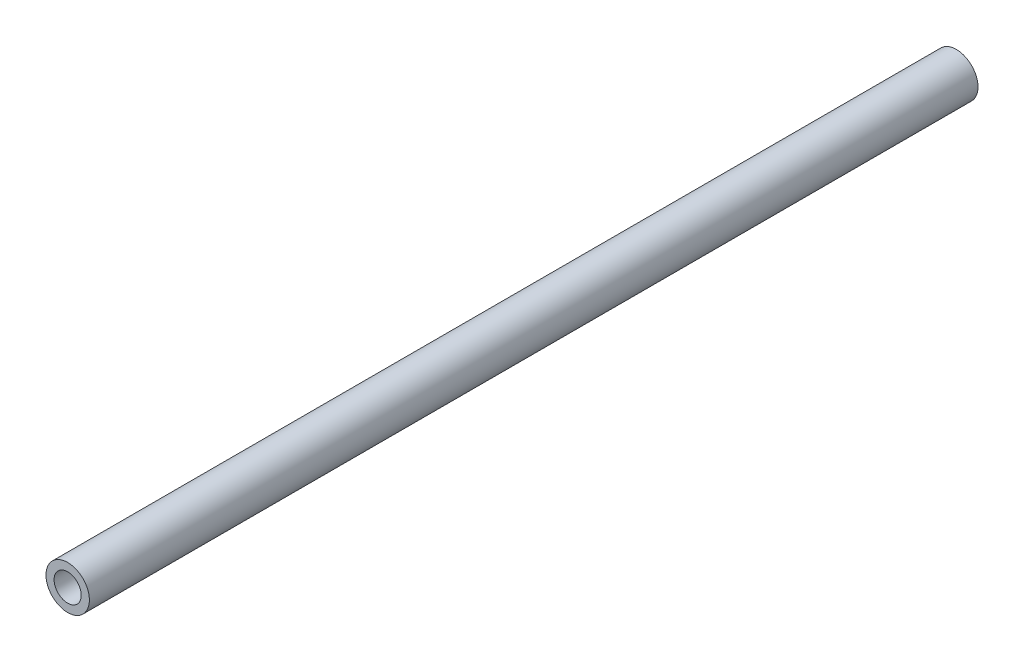
ISO-10303-21;
HEADER;
FILE_DESCRIPTION(('STEP AP214'),'2;1');
FILE_NAME('part.step','',(''),(''),'','','');
FILE_SCHEMA(('AUTOMOTIVE_DESIGN { 1 0 10303 214 1 1 1 1 }'));
ENDSEC;
DATA;
#1=APPLICATION_CONTEXT('core data for automotive mechanical design processes');
#2=APPLICATION_PROTOCOL_DEFINITION('international standard','automotive_design',2000,#1);
#3=PRODUCT_CONTEXT('',#1,'mechanical');
#4=PRODUCT('Part','Part','',(#3));
#5=PRODUCT_RELATED_PRODUCT_CATEGORY('part','',(#4));
#6=PRODUCT_DEFINITION_FORMATION('','',#4);
#7=PRODUCT_DEFINITION_CONTEXT('part definition',#1,'design');
#8=PRODUCT_DEFINITION('design','',#6,#7);
#9=PRODUCT_DEFINITION_SHAPE('','',#8);
#10=(LENGTH_UNIT() NAMED_UNIT(*) SI_UNIT(.MILLI.,.METRE.));
#11=(NAMED_UNIT(*) PLANE_ANGLE_UNIT() SI_UNIT($,.RADIAN.));
#12=(NAMED_UNIT(*) SI_UNIT($,.STERADIAN.) SOLID_ANGLE_UNIT());
#13=UNCERTAINTY_MEASURE_WITH_UNIT(LENGTH_MEASURE(1.E-05),#10,'distance_accuracy_value','');
#14=(GEOMETRIC_REPRESENTATION_CONTEXT(3) GLOBAL_UNCERTAINTY_ASSIGNED_CONTEXT((#13)) GLOBAL_UNIT_ASSIGNED_CONTEXT((#10,
#11,#12)) REPRESENTATION_CONTEXT('',''));
#15=CARTESIAN_POINT('',(0.,0.,0.));
#16=DIRECTION('',(0.,0.,1.));
#17=DIRECTION('',(1.,0.,0.));
#18=AXIS2_PLACEMENT_3D('',#15,#16,#17);
#19=CARTESIAN_POINT('',(0.,0.,-350.));
#20=DIRECTION('',(0.,0.,1.));
#21=DIRECTION('',(1.,0.,0.));
#22=AXIS2_PLACEMENT_3D('',#19,#20,#21);
#23=CYLINDRICAL_SURFACE('',#22,8.55);
#24=CARTESIAN_POINT('',(0.,0.,-350.));
#25=DIRECTION('',(0.,0.,1.));
#26=DIRECTION('',(1.,0.,0.));
#27=AXIS2_PLACEMENT_3D('',#24,#25,#26);
#28=CIRCLE('',#27,8.55);
#29=CARTESIAN_POINT('',(8.55,0.,-350.));
#30=VERTEX_POINT('',#29);
#31=EDGE_CURVE('E10',#30,#30,#28,.T.);
#32=ORIENTED_EDGE('',*,*,#31,.T.);
#33=EDGE_LOOP('',(#32));
#34=FACE_BOUND('',#33,.T.);
#35=CARTESIAN_POINT('',(0.,0.,0.));
#36=DIRECTION('',(0.,0.,1.));
#37=DIRECTION('',(1.,0.,0.));
#38=AXIS2_PLACEMENT_3D('',#35,#36,#37);
#39=CIRCLE('',#38,8.55);
#40=CARTESIAN_POINT('',(8.55,0.,0.));
#41=VERTEX_POINT('',#40);
#42=EDGE_CURVE('E35',#41,#41,#39,.T.);
#43=ORIENTED_EDGE('',*,*,#42,.F.);
#44=EDGE_LOOP('',(#43));
#45=FACE_BOUND('',#44,.T.);
#46=ADVANCED_FACE('F32',(#34,#45),#23,.T.);
#47=CARTESIAN_POINT('',(0.,0.,-350.));
#48=DIRECTION('',(0.,0.,1.));
#49=DIRECTION('',(1.,0.,0.));
#50=AXIS2_PLACEMENT_3D('',#47,#48,#49);
#51=PLANE('',#50);
#52=CARTESIAN_POINT('',(0.,0.,-350.));
#53=DIRECTION('',(0.,0.,1.));
#54=DIRECTION('',(1.,0.,0.));
#55=AXIS2_PLACEMENT_3D('',#52,#53,#54);
#56=CIRCLE('',#55,5.35);
#57=CARTESIAN_POINT('',(5.35,0.,-350.));
#58=VERTEX_POINT('',#57);
#59=EDGE_CURVE('E42',#58,#58,#56,.T.);
#60=ORIENTED_EDGE('',*,*,#59,.T.);
#61=EDGE_LOOP('',(#60));
#62=FACE_BOUND('',#61,.T.);
#63=ORIENTED_EDGE('',*,*,#31,.F.);
#64=EDGE_LOOP('',(#63));
#65=FACE_BOUND('',#64,.T.);
#66=ADVANCED_FACE('F50',(#62,#65),#51,.F.);
#67=CARTESIAN_POINT('',(0.,0.,0.));
#68=DIRECTION('',(0.,0.,1.));
#69=DIRECTION('',(1.,0.,0.));
#70=AXIS2_PLACEMENT_3D('',#67,#68,#69);
#71=PLANE('',#70);
#72=CARTESIAN_POINT('',(0.,0.,0.));
#73=DIRECTION('',(0.,0.,1.));
#74=DIRECTION('',(1.,0.,0.));
#75=AXIS2_PLACEMENT_3D('',#72,#73,#74);
#76=CIRCLE('',#75,5.35);
#77=CARTESIAN_POINT('',(5.35,0.,0.));
#78=VERTEX_POINT('',#77);
#79=EDGE_CURVE('E44',#78,#78,#76,.T.);
#80=ORIENTED_EDGE('',*,*,#79,.F.);
#81=EDGE_LOOP('',(#80));
#82=FACE_BOUND('',#81,.T.);
#83=ORIENTED_EDGE('',*,*,#42,.T.);
#84=EDGE_LOOP('',(#83));
#85=FACE_BOUND('',#84,.T.);
#86=ADVANCED_FACE('F56',(#82,#85),#71,.T.);
#87=CARTESIAN_POINT('',(0.,0.,-350.));
#88=DIRECTION('',(0.,0.,1.));
#89=DIRECTION('',(1.,0.,0.));
#90=AXIS2_PLACEMENT_3D('',#87,#88,#89);
#91=CYLINDRICAL_SURFACE('',#90,5.35);
#92=ORIENTED_EDGE('',*,*,#59,.F.);
#93=EDGE_LOOP('',(#92));
#94=FACE_BOUND('',#93,.T.);
#95=ORIENTED_EDGE('',*,*,#79,.T.);
#96=EDGE_LOOP('',(#95));
#97=FACE_BOUND('',#96,.T.);
#98=ADVANCED_FACE('F53',(#94,#97),#91,.F.);
#99=CLOSED_SHELL('',(#46,#66,#86,#98));
#100=MANIFOLD_SOLID_BREP('B2',#99);
#101=ADVANCED_BREP_SHAPE_REPRESENTATION('',(#18,#100),#14);
#102=SHAPE_DEFINITION_REPRESENTATION(#9,#101);
ENDSEC;
END-ISO-10303-21;
